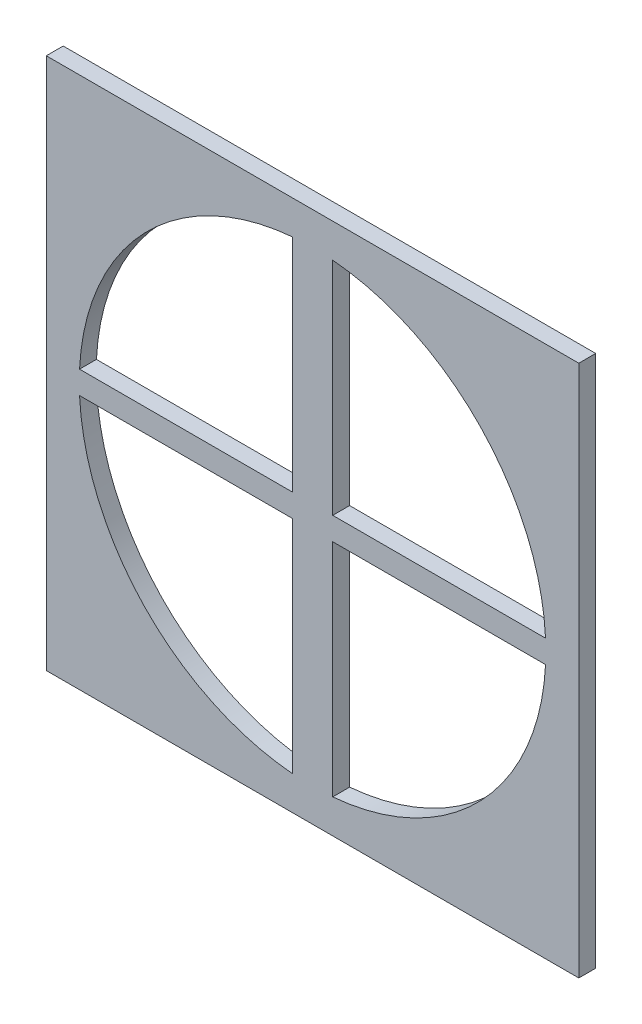
ISO-10303-21;
HEADER;
FILE_DESCRIPTION(('STEP AP214'),'2;1');
FILE_NAME('part.step','',(''),(''),'','','');
FILE_SCHEMA(('AUTOMOTIVE_DESIGN { 1 0 10303 214 1 1 1 1 }'));
ENDSEC;
DATA;
#1=APPLICATION_CONTEXT('core data for automotive mechanical design processes');
#2=APPLICATION_PROTOCOL_DEFINITION('international standard','automotive_design',2000,#1);
#3=PRODUCT_CONTEXT('',#1,'mechanical');
#4=PRODUCT('Part','Part','',(#3));
#5=PRODUCT_RELATED_PRODUCT_CATEGORY('part','',(#4));
#6=PRODUCT_DEFINITION_FORMATION('','',#4);
#7=PRODUCT_DEFINITION_CONTEXT('part definition',#1,'design');
#8=PRODUCT_DEFINITION('design','',#6,#7);
#9=PRODUCT_DEFINITION_SHAPE('','',#8);
#10=(LENGTH_UNIT() NAMED_UNIT(*) SI_UNIT(.MILLI.,.METRE.));
#11=(NAMED_UNIT(*) PLANE_ANGLE_UNIT() SI_UNIT($,.RADIAN.));
#12=(NAMED_UNIT(*) SI_UNIT($,.STERADIAN.) SOLID_ANGLE_UNIT());
#13=UNCERTAINTY_MEASURE_WITH_UNIT(LENGTH_MEASURE(1.E-05),#10,'distance_accuracy_value','');
#14=(GEOMETRIC_REPRESENTATION_CONTEXT(3) GLOBAL_UNCERTAINTY_ASSIGNED_CONTEXT((#13)) GLOBAL_UNIT_ASSIGNED_CONTEXT((#10,
#11,#12)) REPRESENTATION_CONTEXT('',''));
#15=CARTESIAN_POINT('',(0.,0.,0.));
#16=DIRECTION('',(0.,0.,1.));
#17=DIRECTION('',(1.,0.,0.));
#18=AXIS2_PLACEMENT_3D('',#15,#16,#17);
#19=CARTESIAN_POINT('',(0.,0.,0.));
#20=DIRECTION('',(0.,0.,1.));
#21=DIRECTION('',(1.,0.,0.));
#22=AXIS2_PLACEMENT_3D('',#19,#20,#21);
#23=CYLINDRICAL_SURFACE('',#22,35.052);
#24=CARTESIAN_POINT('',(0.,0.,2.54));
#25=DIRECTION('',(0.,0.,1.));
#26=DIRECTION('',(1.,0.,0.));
#27=AXIS2_PLACEMENT_3D('',#24,#25,#26);
#28=CIRCLE('',#27,35.052);
#29=CARTESIAN_POINT('',(-3.03268673599824,-34.9205600636831,2.54));
#30=VERTEX_POINT('',#29);
#31=CARTESIAN_POINT('',(-35.0099405381265,-1.7166151335839,2.54));
#32=VERTEX_POINT('',#31);
#33=EDGE_CURVE('E58',#30,#32,#28,.F.);
#34=ORIENTED_EDGE('',*,*,#33,.F.);
#35=DIRECTION('',(0.,0.,1.));
#36=VECTOR('',#35,1.);
#37=CARTESIAN_POINT('',(-3.03268673599824,-34.9205600636831,0.));
#38=LINE('',#37,#36);
#39=CARTESIAN_POINT('',(-3.03268673599824,-34.9205600636831,0.));
#40=VERTEX_POINT('',#39);
#41=EDGE_CURVE('E244',#40,#30,#38,.T.);
#42=ORIENTED_EDGE('',*,*,#41,.F.);
#43=CARTESIAN_POINT('',(0.,0.,0.));
#44=DIRECTION('',(0.,0.,1.));
#45=DIRECTION('',(1.,0.,0.));
#46=AXIS2_PLACEMENT_3D('',#43,#44,#45);
#47=CIRCLE('',#46,35.052);
#48=CARTESIAN_POINT('',(-35.0099405381265,-1.7166151335839,0.));
#49=VERTEX_POINT('',#48);
#50=EDGE_CURVE('E307',#49,#40,#47,.T.);
#51=ORIENTED_EDGE('',*,*,#50,.F.);
#52=DIRECTION('',(0.,0.,1.));
#53=VECTOR('',#52,1.);
#54=CARTESIAN_POINT('',(-35.0099405381265,-1.7166151335839,0.));
#55=LINE('',#54,#53);
#56=EDGE_CURVE('E250',#49,#32,#55,.T.);
#57=ORIENTED_EDGE('',*,*,#56,.T.);
#58=EDGE_LOOP('',(#34,#42,#51,#57));
#59=FACE_BOUND('',#58,.T.);
#60=ADVANCED_FACE('F35',(#59),#23,.F.);
#61=CARTESIAN_POINT('',(0.,0.,2.54));
#62=DIRECTION('',(0.,0.,1.));
#63=DIRECTION('',(1.,0.,0.));
#64=AXIS2_PLACEMENT_3D('',#61,#62,#63);
#65=CIRCLE('',#64,35.052);
#66=CARTESIAN_POINT('',(-35.0099405381265,1.71661513358393,2.54));
#67=VERTEX_POINT('',#66);
#68=CARTESIAN_POINT('',(-3.03268673599824,34.9205600636831,2.54));
#69=VERTEX_POINT('',#68);
#70=EDGE_CURVE('E291',#67,#69,#65,.F.);
#71=ORIENTED_EDGE('',*,*,#70,.F.);
#72=DIRECTION('',(0.,0.,1.));
#73=VECTOR('',#72,1.);
#74=CARTESIAN_POINT('',(-35.0099405381265,1.71661513358393,0.));
#75=LINE('',#74,#73);
#76=CARTESIAN_POINT('',(-35.0099405381265,1.71661513358393,0.));
#77=VERTEX_POINT('',#76);
#78=EDGE_CURVE('E253',#77,#67,#75,.T.);
#79=ORIENTED_EDGE('',*,*,#78,.F.);
#80=CARTESIAN_POINT('',(-3.03268673599824,34.9205600636831,0.));
#81=VERTEX_POINT('',#80);
#82=EDGE_CURVE('E180',#81,#77,#47,.T.);
#83=ORIENTED_EDGE('',*,*,#82,.F.);
#84=DIRECTION('',(0.,0.,1.));
#85=VECTOR('',#84,1.);
#86=CARTESIAN_POINT('',(-3.03268673599824,34.9205600636831,0.));
#87=LINE('',#86,#85);
#88=EDGE_CURVE('E259',#81,#69,#87,.T.);
#89=ORIENTED_EDGE('',*,*,#88,.T.);
#90=EDGE_LOOP('',(#71,#79,#83,#89));
#91=FACE_BOUND('',#90,.T.);
#92=ADVANCED_FACE('F326',(#91),#23,.F.);
#93=CARTESIAN_POINT('',(0.,0.,2.54));
#94=DIRECTION('',(0.,0.,1.));
#95=DIRECTION('',(1.,0.,0.));
#96=AXIS2_PLACEMENT_3D('',#93,#94,#95);
#97=CIRCLE('',#96,35.052);
#98=CARTESIAN_POINT('',(3.03268673599824,34.9205600636831,2.54));
#99=VERTEX_POINT('',#98);
#100=CARTESIAN_POINT('',(35.0099405381265,1.71661513358393,2.54));
#101=VERTEX_POINT('',#100);
#102=EDGE_CURVE('E272',#99,#101,#97,.F.);
#103=ORIENTED_EDGE('',*,*,#102,.F.);
#104=DIRECTION('',(0.,0.,1.));
#105=VECTOR('',#104,1.);
#106=CARTESIAN_POINT('',(3.03268673599824,34.9205600636831,0.));
#107=LINE('',#106,#105);
#108=CARTESIAN_POINT('',(3.03268673599824,34.9205600636831,0.));
#109=VERTEX_POINT('',#108);
#110=EDGE_CURVE('E262',#109,#99,#107,.T.);
#111=ORIENTED_EDGE('',*,*,#110,.F.);
#112=CARTESIAN_POINT('',(35.0099405381265,1.71661513358393,0.));
#113=VERTEX_POINT('',#112);
#114=EDGE_CURVE('E176',#113,#109,#47,.T.);
#115=ORIENTED_EDGE('',*,*,#114,.F.);
#116=DIRECTION('',(0.,0.,1.));
#117=VECTOR('',#116,1.);
#118=CARTESIAN_POINT('',(35.0099405381265,1.71661513358393,0.));
#119=LINE('',#118,#117);
#120=EDGE_CURVE('E170',#113,#101,#119,.T.);
#121=ORIENTED_EDGE('',*,*,#120,.T.);
#122=EDGE_LOOP('',(#103,#111,#115,#121));
#123=FACE_BOUND('',#122,.T.);
#124=ADVANCED_FACE('F271',(#123),#23,.F.);
#125=CARTESIAN_POINT('',(40.005,-40.0005,5.08));
#126=DIRECTION('',(-1.,0.,0.));
#127=DIRECTION('',(0.,0.,1.));
#128=AXIS2_PLACEMENT_3D('',#125,#126,#127);
#129=PLANE('',#128);
#130=DIRECTION('',(0.,1.,0.));
#131=VECTOR('',#130,1.);
#132=CARTESIAN_POINT('',(40.005,-40.0005,2.54));
#133=LINE('',#132,#131);
#134=CARTESIAN_POINT('',(40.005,-40.0005,2.54));
#135=VERTEX_POINT('',#134);
#136=CARTESIAN_POINT('',(40.005,40.0005,2.54));
#137=VERTEX_POINT('',#136);
#138=EDGE_CURVE('E213',#135,#137,#133,.T.);
#139=ORIENTED_EDGE('',*,*,#138,.F.);
#140=DIRECTION('',(0.,0.,-1.));
#141=VECTOR('',#140,1.);
#142=CARTESIAN_POINT('',(40.005,-40.0005,5.08));
#143=LINE('',#142,#141);
#144=CARTESIAN_POINT('',(40.005,-40.0005,0.));
#145=VERTEX_POINT('',#144);
#146=EDGE_CURVE('E193',#135,#145,#143,.T.);
#147=ORIENTED_EDGE('',*,*,#146,.T.);
#148=DIRECTION('',(0.,1.,0.));
#149=VECTOR('',#148,1.);
#150=CARTESIAN_POINT('',(40.005,-40.0005,0.));
#151=LINE('',#150,#149);
#152=CARTESIAN_POINT('',(40.005,40.0005,0.));
#153=VERTEX_POINT('',#152);
#154=EDGE_CURVE('E179',#145,#153,#151,.T.);
#155=ORIENTED_EDGE('',*,*,#154,.T.);
#156=DIRECTION('',(0.,0.,-1.));
#157=VECTOR('',#156,1.);
#158=CARTESIAN_POINT('',(40.005,40.0005,5.08));
#159=LINE('',#158,#157);
#160=EDGE_CURVE('E43',#137,#153,#159,.T.);
#161=ORIENTED_EDGE('',*,*,#160,.F.);
#162=EDGE_LOOP('',(#139,#147,#155,#161));
#163=FACE_BOUND('',#162,.T.);
#164=ADVANCED_FACE('F37',(#163),#129,.F.);
#165=CARTESIAN_POINT('',(-40.005,40.0005,5.08));
#166=DIRECTION('',(0.,-1.,0.));
#167=DIRECTION('',(0.,0.,-1.));
#168=AXIS2_PLACEMENT_3D('',#165,#166,#167);
#169=PLANE('',#168);
#170=DIRECTION('',(-1.,0.,0.));
#171=VECTOR('',#170,1.);
#172=CARTESIAN_POINT('',(-40.005,40.0005,2.54));
#173=LINE('',#172,#171);
#174=CARTESIAN_POINT('',(-40.005,40.0005,2.54));
#175=VERTEX_POINT('',#174);
#176=EDGE_CURVE('E205',#137,#175,#173,.T.);
#177=ORIENTED_EDGE('',*,*,#176,.F.);
#178=ORIENTED_EDGE('',*,*,#160,.T.);
#179=DIRECTION('',(-1.,0.,0.));
#180=VECTOR('',#179,1.);
#181=CARTESIAN_POINT('',(-40.005,40.0005,0.));
#182=LINE('',#181,#180);
#183=CARTESIAN_POINT('',(-40.005,40.0005,0.));
#184=VERTEX_POINT('',#183);
#185=EDGE_CURVE('E184',#153,#184,#182,.T.);
#186=ORIENTED_EDGE('',*,*,#185,.T.);
#187=DIRECTION('',(0.,0.,-1.));
#188=VECTOR('',#187,1.);
#189=CARTESIAN_POINT('',(-40.005,40.0005,5.08));
#190=LINE('',#189,#188);
#191=EDGE_CURVE('E197',#175,#184,#190,.T.);
#192=ORIENTED_EDGE('',*,*,#191,.F.);
#193=EDGE_LOOP('',(#177,#178,#186,#192));
#194=FACE_BOUND('',#193,.T.);
#195=ADVANCED_FACE('F202',(#194),#169,.F.);
#196=CARTESIAN_POINT('',(-40.005,-40.0005,5.08));
#197=DIRECTION('',(1.,0.,0.));
#198=DIRECTION('',(0.,0.,-1.));
#199=AXIS2_PLACEMENT_3D('',#196,#197,#198);
#200=PLANE('',#199);
#201=DIRECTION('',(0.,-1.,0.));
#202=VECTOR('',#201,1.);
#203=CARTESIAN_POINT('',(-40.005,-40.0005,2.54));
#204=LINE('',#203,#202);
#205=CARTESIAN_POINT('',(-40.005,-40.0005,2.54));
#206=VERTEX_POINT('',#205);
#207=EDGE_CURVE('E50',#175,#206,#204,.T.);
#208=ORIENTED_EDGE('',*,*,#207,.F.);
#209=ORIENTED_EDGE('',*,*,#191,.T.);
#210=DIRECTION('',(0.,-1.,0.));
#211=VECTOR('',#210,1.);
#212=CARTESIAN_POINT('',(-40.005,-40.0005,0.));
#213=LINE('',#212,#211);
#214=CARTESIAN_POINT('',(-40.005,-40.0005,0.));
#215=VERTEX_POINT('',#214);
#216=EDGE_CURVE('E187',#184,#215,#213,.T.);
#217=ORIENTED_EDGE('',*,*,#216,.T.);
#218=DIRECTION('',(0.,0.,-1.));
#219=VECTOR('',#218,1.);
#220=CARTESIAN_POINT('',(-40.005,-40.0005,5.08));
#221=LINE('',#220,#219);
#222=EDGE_CURVE('E195',#206,#215,#221,.T.);
#223=ORIENTED_EDGE('',*,*,#222,.F.);
#224=EDGE_LOOP('',(#208,#209,#217,#223));
#225=FACE_BOUND('',#224,.T.);
#226=ADVANCED_FACE('F219',(#225),#200,.F.);
#227=CARTESIAN_POINT('',(-40.005,-40.0005,5.08));
#228=DIRECTION('',(0.,1.,0.));
#229=DIRECTION('',(0.,0.,1.));
#230=AXIS2_PLACEMENT_3D('',#227,#228,#229);
#231=PLANE('',#230);
#232=DIRECTION('',(1.,0.,0.));
#233=VECTOR('',#232,1.);
#234=CARTESIAN_POINT('',(-40.005,-40.0005,2.54));
#235=LINE('',#234,#233);
#236=EDGE_CURVE('E217',#206,#135,#235,.T.);
#237=ORIENTED_EDGE('',*,*,#236,.F.);
#238=ORIENTED_EDGE('',*,*,#222,.T.);
#239=DIRECTION('',(1.,0.,0.));
#240=VECTOR('',#239,1.);
#241=CARTESIAN_POINT('',(-40.005,-40.0005,0.));
#242=LINE('',#241,#240);
#243=EDGE_CURVE('E190',#215,#145,#242,.T.);
#244=ORIENTED_EDGE('',*,*,#243,.T.);
#245=ORIENTED_EDGE('',*,*,#146,.F.);
#246=EDGE_LOOP('',(#237,#238,#244,#245));
#247=FACE_BOUND('',#246,.T.);
#248=ADVANCED_FACE('F215',(#247),#231,.F.);
#249=CARTESIAN_POINT('',(0.,0.,2.54));
#250=DIRECTION('',(0.,0.,1.));
#251=DIRECTION('',(1.,0.,0.));
#252=AXIS2_PLACEMENT_3D('',#249,#250,#251);
#253=CIRCLE('',#252,35.052);
#254=CARTESIAN_POINT('',(35.0099405381265,-1.7166151335839,2.54));
#255=VERTEX_POINT('',#254);
#256=CARTESIAN_POINT('',(3.03268673599824,-34.9205600636831,2.54));
#257=VERTEX_POINT('',#256);
#258=EDGE_CURVE('E151',#255,#257,#253,.F.);
#259=ORIENTED_EDGE('',*,*,#258,.F.);
#260=DIRECTION('',(0.,0.,1.));
#261=VECTOR('',#260,1.);
#262=CARTESIAN_POINT('',(35.0099405381265,-1.7166151335839,0.));
#263=LINE('',#262,#261);
#264=CARTESIAN_POINT('',(35.0099405381265,-1.7166151335839,0.));
#265=VERTEX_POINT('',#264);
#266=EDGE_CURVE('E162',#265,#255,#263,.T.);
#267=ORIENTED_EDGE('',*,*,#266,.F.);
#268=CARTESIAN_POINT('',(3.03268673599824,-34.9205600636831,0.));
#269=VERTEX_POINT('',#268);
#270=EDGE_CURVE('E181',#269,#265,#47,.T.);
#271=ORIENTED_EDGE('',*,*,#270,.F.);
#272=DIRECTION('',(0.,0.,1.));
#273=VECTOR('',#272,1.);
#274=CARTESIAN_POINT('',(3.03268673599824,-34.9205600636831,0.));
#275=LINE('',#274,#273);
#276=EDGE_CURVE('E168',#269,#257,#275,.T.);
#277=ORIENTED_EDGE('',*,*,#276,.T.);
#278=EDGE_LOOP('',(#259,#267,#271,#277));
#279=FACE_BOUND('',#278,.T.);
#280=ADVANCED_FACE('F312',(#279),#23,.F.);
#281=CARTESIAN_POINT('',(-3.03268673599824,0.,0.));
#282=DIRECTION('',(1.,0.,0.));
#283=DIRECTION('',(0.,0.,-1.));
#284=AXIS2_PLACEMENT_3D('',#281,#282,#283);
#285=PLANE('',#284);
#286=DIRECTION('',(0.,-1.,0.));
#287=VECTOR('',#286,1.);
#288=CARTESIAN_POINT('',(-3.03268673599824,0.,2.54));
#289=LINE('',#288,#287);
#290=CARTESIAN_POINT('',(-3.03268673599824,-1.7166151335839,2.54));
#291=VERTEX_POINT('',#290);
#292=EDGE_CURVE('E295',#291,#30,#289,.T.);
#293=ORIENTED_EDGE('',*,*,#292,.F.);
#294=DIRECTION('',(0.,0.,1.));
#295=VECTOR('',#294,1.);
#296=CARTESIAN_POINT('',(-3.03268673599824,-1.7166151335839,0.));
#297=LINE('',#296,#295);
#298=CARTESIAN_POINT('',(-3.03268673599824,-1.7166151335839,0.));
#299=VERTEX_POINT('',#298);
#300=EDGE_CURVE('E247',#299,#291,#297,.T.);
#301=ORIENTED_EDGE('',*,*,#300,.F.);
#302=DIRECTION('',(0.,1.,0.));
#303=VECTOR('',#302,1.);
#304=CARTESIAN_POINT('',(-3.03268673599824,0.,0.));
#305=LINE('',#304,#303);
#306=EDGE_CURVE('E172',#40,#299,#305,.T.);
#307=ORIENTED_EDGE('',*,*,#306,.F.);
#308=ORIENTED_EDGE('',*,*,#41,.T.);
#309=EDGE_LOOP('',(#293,#301,#307,#308));
#310=FACE_BOUND('',#309,.T.);
#311=ADVANCED_FACE('F303',(#310),#285,.F.);
#312=CARTESIAN_POINT('',(0.,-1.7166151335839,0.));
#313=DIRECTION('',(0.,-1.,0.));
#314=DIRECTION('',(0.,0.,-1.));
#315=AXIS2_PLACEMENT_3D('',#312,#313,#314);
#316=PLANE('',#315);
#317=ORIENTED_EDGE('',*,*,#300,.T.);
#318=DIRECTION('',(-1.,0.,0.));
#319=VECTOR('',#318,1.);
#320=CARTESIAN_POINT('',(0.,-1.7166151335839,2.54));
#321=LINE('',#320,#319);
#322=EDGE_CURVE('E293',#291,#32,#321,.T.);
#323=ORIENTED_EDGE('',*,*,#322,.T.);
#324=ORIENTED_EDGE('',*,*,#56,.F.);
#325=DIRECTION('',(1.,0.,0.));
#326=VECTOR('',#325,1.);
#327=CARTESIAN_POINT('',(0.,-1.7166151335839,0.));
#328=LINE('',#327,#326);
#329=EDGE_CURVE('E240',#49,#299,#328,.T.);
#330=ORIENTED_EDGE('',*,*,#329,.T.);
#331=EDGE_LOOP('',(#317,#323,#324,#330));
#332=FACE_BOUND('',#331,.T.);
#333=ADVANCED_FACE('F319',(#332),#316,.T.);
#334=CARTESIAN_POINT('',(0.,1.71661513358393,0.));
#335=DIRECTION('',(0.,-1.,0.));
#336=DIRECTION('',(0.,0.,-1.));
#337=AXIS2_PLACEMENT_3D('',#334,#335,#336);
#338=PLANE('',#337);
#339=DIRECTION('',(-1.,0.,0.));
#340=VECTOR('',#339,1.);
#341=CARTESIAN_POINT('',(0.,1.71661513358393,2.54));
#342=LINE('',#341,#340);
#343=CARTESIAN_POINT('',(-3.03268673599824,1.71661513358393,2.54));
#344=VERTEX_POINT('',#343);
#345=EDGE_CURVE('E289',#344,#67,#342,.T.);
#346=ORIENTED_EDGE('',*,*,#345,.F.);
#347=DIRECTION('',(0.,0.,1.));
#348=VECTOR('',#347,1.);
#349=CARTESIAN_POINT('',(-3.03268673599824,1.71661513358393,0.));
#350=LINE('',#349,#348);
#351=CARTESIAN_POINT('',(-3.03268673599824,1.71661513358393,0.));
#352=VERTEX_POINT('',#351);
#353=EDGE_CURVE('E256',#352,#344,#350,.T.);
#354=ORIENTED_EDGE('',*,*,#353,.F.);
#355=DIRECTION('',(1.,0.,0.));
#356=VECTOR('',#355,1.);
#357=CARTESIAN_POINT('',(0.,1.71661513358393,0.));
#358=LINE('',#357,#356);
#359=EDGE_CURVE('E238',#77,#352,#358,.T.);
#360=ORIENTED_EDGE('',*,*,#359,.F.);
#361=ORIENTED_EDGE('',*,*,#78,.T.);
#362=EDGE_LOOP('',(#346,#354,#360,#361));
#363=FACE_BOUND('',#362,.T.);
#364=ADVANCED_FACE('F340',(#363),#338,.F.);
#365=CARTESIAN_POINT('',(-3.03268673599824,0.,0.));
#366=DIRECTION('',(1.,0.,0.));
#367=DIRECTION('',(0.,0.,-1.));
#368=AXIS2_PLACEMENT_3D('',#365,#366,#367);
#369=PLANE('',#368);
#370=DIRECTION('',(0.,-1.,0.));
#371=VECTOR('',#370,1.);
#372=CARTESIAN_POINT('',(-3.03268673599824,0.,2.54));
#373=LINE('',#372,#371);
#374=EDGE_CURVE('E287',#69,#344,#373,.T.);
#375=ORIENTED_EDGE('',*,*,#374,.F.);
#376=ORIENTED_EDGE('',*,*,#88,.F.);
#377=DIRECTION('',(0.,1.,0.));
#378=VECTOR('',#377,1.);
#379=CARTESIAN_POINT('',(-3.03268673599824,0.,0.));
#380=LINE('',#379,#378);
#381=EDGE_CURVE('E235',#352,#81,#380,.T.);
#382=ORIENTED_EDGE('',*,*,#381,.F.);
#383=ORIENTED_EDGE('',*,*,#353,.T.);
#384=EDGE_LOOP('',(#375,#376,#382,#383));
#385=FACE_BOUND('',#384,.T.);
#386=ADVANCED_FACE('F345',(#385),#369,.F.);
#387=CARTESIAN_POINT('',(3.03268673599824,0.,0.));
#388=DIRECTION('',(1.,0.,0.));
#389=DIRECTION('',(0.,0.,-1.));
#390=AXIS2_PLACEMENT_3D('',#387,#388,#389);
#391=PLANE('',#390);
#392=ORIENTED_EDGE('',*,*,#110,.T.);
#393=DIRECTION('',(0.,-1.,0.));
#394=VECTOR('',#393,1.);
#395=CARTESIAN_POINT('',(3.03268673599824,0.,2.54));
#396=LINE('',#395,#394);
#397=CARTESIAN_POINT('',(3.03268673599824,1.71661513358393,2.54));
#398=VERTEX_POINT('',#397);
#399=EDGE_CURVE('E281',#99,#398,#396,.T.);
#400=ORIENTED_EDGE('',*,*,#399,.T.);
#401=DIRECTION('',(0.,0.,1.));
#402=VECTOR('',#401,1.);
#403=CARTESIAN_POINT('',(3.03268673599824,1.71661513358393,0.));
#404=LINE('',#403,#402);
#405=CARTESIAN_POINT('',(3.03268673599824,1.71661513358393,0.));
#406=VERTEX_POINT('',#405);
#407=EDGE_CURVE('E265',#406,#398,#404,.T.);
#408=ORIENTED_EDGE('',*,*,#407,.F.);
#409=DIRECTION('',(0.,1.,0.));
#410=VECTOR('',#409,1.);
#411=CARTESIAN_POINT('',(3.03268673599824,0.,0.));
#412=LINE('',#411,#410);
#413=EDGE_CURVE('E232',#406,#109,#412,.T.);
#414=ORIENTED_EDGE('',*,*,#413,.T.);
#415=EDGE_LOOP('',(#392,#400,#408,#414));
#416=FACE_BOUND('',#415,.T.);
#417=ADVANCED_FACE('F359',(#416),#391,.T.);
#418=CARTESIAN_POINT('',(0.,1.71661513358393,0.));
#419=DIRECTION('',(0.,-1.,0.));
#420=DIRECTION('',(0.,0.,-1.));
#421=AXIS2_PLACEMENT_3D('',#418,#419,#420);
#422=PLANE('',#421);
#423=DIRECTION('',(-1.,0.,0.));
#424=VECTOR('',#423,1.);
#425=CARTESIAN_POINT('',(0.,1.71661513358393,2.54));
#426=LINE('',#425,#424);
#427=EDGE_CURVE('E278',#101,#398,#426,.T.);
#428=ORIENTED_EDGE('',*,*,#427,.F.);
#429=ORIENTED_EDGE('',*,*,#120,.F.);
#430=DIRECTION('',(1.,0.,0.));
#431=VECTOR('',#430,1.);
#432=CARTESIAN_POINT('',(0.,1.71661513358393,0.));
#433=LINE('',#432,#431);
#434=EDGE_CURVE('E229',#406,#113,#433,.T.);
#435=ORIENTED_EDGE('',*,*,#434,.F.);
#436=ORIENTED_EDGE('',*,*,#407,.T.);
#437=EDGE_LOOP('',(#428,#429,#435,#436));
#438=FACE_BOUND('',#437,.T.);
#439=ADVANCED_FACE('F276',(#438),#422,.F.);
#440=CARTESIAN_POINT('',(0.,-1.7166151335839,0.));
#441=DIRECTION('',(0.,-1.,0.));
#442=DIRECTION('',(0.,0.,-1.));
#443=AXIS2_PLACEMENT_3D('',#440,#441,#442);
#444=PLANE('',#443);
#445=ORIENTED_EDGE('',*,*,#266,.T.);
#446=DIRECTION('',(-1.,0.,0.));
#447=VECTOR('',#446,1.);
#448=CARTESIAN_POINT('',(0.,-1.7166151335839,2.54));
#449=LINE('',#448,#447);
#450=CARTESIAN_POINT('',(3.03268673599824,-1.7166151335839,2.54));
#451=VERTEX_POINT('',#450);
#452=EDGE_CURVE('E149',#255,#451,#449,.T.);
#453=ORIENTED_EDGE('',*,*,#452,.T.);
#454=DIRECTION('',(0.,0.,1.));
#455=VECTOR('',#454,1.);
#456=CARTESIAN_POINT('',(3.03268673599824,-1.7166151335839,0.));
#457=LINE('',#456,#455);
#458=CARTESIAN_POINT('',(3.03268673599824,-1.7166151335839,0.));
#459=VERTEX_POINT('',#458);
#460=EDGE_CURVE('E160',#459,#451,#457,.T.);
#461=ORIENTED_EDGE('',*,*,#460,.F.);
#462=DIRECTION('',(1.,0.,0.));
#463=VECTOR('',#462,1.);
#464=CARTESIAN_POINT('',(0.,-1.7166151335839,0.));
#465=LINE('',#464,#463);
#466=EDGE_CURVE('E227',#459,#265,#465,.T.);
#467=ORIENTED_EDGE('',*,*,#466,.T.);
#468=EDGE_LOOP('',(#445,#453,#461,#467));
#469=FACE_BOUND('',#468,.T.);
#470=ADVANCED_FACE('F158',(#469),#444,.T.);
#471=CARTESIAN_POINT('',(3.03268673599824,0.,0.));
#472=DIRECTION('',(1.,0.,0.));
#473=DIRECTION('',(0.,0.,-1.));
#474=AXIS2_PLACEMENT_3D('',#471,#472,#473);
#475=PLANE('',#474);
#476=ORIENTED_EDGE('',*,*,#460,.T.);
#477=DIRECTION('',(0.,-1.,0.));
#478=VECTOR('',#477,1.);
#479=CARTESIAN_POINT('',(3.03268673599824,0.,2.54));
#480=LINE('',#479,#478);
#481=EDGE_CURVE('E11',#451,#257,#480,.T.);
#482=ORIENTED_EDGE('',*,*,#481,.T.);
#483=ORIENTED_EDGE('',*,*,#276,.F.);
#484=DIRECTION('',(0.,1.,0.));
#485=VECTOR('',#484,1.);
#486=CARTESIAN_POINT('',(3.03268673599824,0.,0.));
#487=LINE('',#486,#485);
#488=EDGE_CURVE('E167',#269,#459,#487,.T.);
#489=ORIENTED_EDGE('',*,*,#488,.T.);
#490=EDGE_LOOP('',(#476,#482,#483,#489));
#491=FACE_BOUND('',#490,.T.);
#492=ADVANCED_FACE('F165',(#491),#475,.T.);
#493=CARTESIAN_POINT('',(0.,0.,0.));
#494=DIRECTION('',(0.,0.,-1.));
#495=DIRECTION('',(-1.,0.,0.));
#496=AXIS2_PLACEMENT_3D('',#493,#494,#495);
#497=PLANE('',#496);
#498=ORIENTED_EDGE('',*,*,#50,.T.);
#499=ORIENTED_EDGE('',*,*,#306,.T.);
#500=ORIENTED_EDGE('',*,*,#329,.F.);
#501=EDGE_LOOP('',(#498,#499,#500));
#502=FACE_BOUND('',#501,.T.);
#503=ORIENTED_EDGE('',*,*,#82,.T.);
#504=ORIENTED_EDGE('',*,*,#359,.T.);
#505=ORIENTED_EDGE('',*,*,#381,.T.);
#506=EDGE_LOOP('',(#503,#504,#505));
#507=FACE_BOUND('',#506,.T.);
#508=ORIENTED_EDGE('',*,*,#114,.T.);
#509=ORIENTED_EDGE('',*,*,#413,.F.);
#510=ORIENTED_EDGE('',*,*,#434,.T.);
#511=EDGE_LOOP('',(#508,#509,#510));
#512=FACE_BOUND('',#511,.T.);
#513=ORIENTED_EDGE('',*,*,#488,.F.);
#514=ORIENTED_EDGE('',*,*,#270,.T.);
#515=ORIENTED_EDGE('',*,*,#466,.F.);
#516=EDGE_LOOP('',(#513,#514,#515));
#517=FACE_BOUND('',#516,.T.);
#518=ORIENTED_EDGE('',*,*,#154,.F.);
#519=ORIENTED_EDGE('',*,*,#243,.F.);
#520=ORIENTED_EDGE('',*,*,#216,.F.);
#521=ORIENTED_EDGE('',*,*,#185,.F.);
#522=EDGE_LOOP('',(#518,#519,#520,#521));
#523=FACE_BOUND('',#522,.T.);
#524=ADVANCED_FACE('F210',(#502,#507,#512,#517,#523),#497,.T.);
#525=CARTESIAN_POINT('',(0.,0.,2.54));
#526=DIRECTION('',(0.,0.,1.));
#527=DIRECTION('',(1.,0.,0.));
#528=AXIS2_PLACEMENT_3D('',#525,#526,#527);
#529=PLANE('',#528);
#530=ORIENTED_EDGE('',*,*,#33,.T.);
#531=ORIENTED_EDGE('',*,*,#322,.F.);
#532=ORIENTED_EDGE('',*,*,#292,.T.);
#533=EDGE_LOOP('',(#530,#531,#532));
#534=FACE_BOUND('',#533,.T.);
#535=ORIENTED_EDGE('',*,*,#102,.T.);
#536=ORIENTED_EDGE('',*,*,#427,.T.);
#537=ORIENTED_EDGE('',*,*,#399,.F.);
#538=EDGE_LOOP('',(#535,#536,#537));
#539=FACE_BOUND('',#538,.T.);
#540=ORIENTED_EDGE('',*,*,#258,.T.);
#541=ORIENTED_EDGE('',*,*,#481,.F.);
#542=ORIENTED_EDGE('',*,*,#452,.F.);
#543=EDGE_LOOP('',(#540,#541,#542));
#544=FACE_BOUND('',#543,.T.);
#545=ORIENTED_EDGE('',*,*,#70,.T.);
#546=ORIENTED_EDGE('',*,*,#374,.T.);
#547=ORIENTED_EDGE('',*,*,#345,.T.);
#548=EDGE_LOOP('',(#545,#546,#547));
#549=FACE_BOUND('',#548,.T.);
#550=ORIENTED_EDGE('',*,*,#138,.T.);
#551=ORIENTED_EDGE('',*,*,#176,.T.);
#552=ORIENTED_EDGE('',*,*,#207,.T.);
#553=ORIENTED_EDGE('',*,*,#236,.T.);
#554=EDGE_LOOP('',(#550,#551,#552,#553));
#555=FACE_BOUND('',#554,.T.);
#556=ADVANCED_FACE('F147',(#534,#539,#544,#549,#555),#529,.T.);
#557=CLOSED_SHELL('',(#60,#92,#124,#164,#195,#226,#248,#280,#311,#333,#364,#386,#417,#439,#470,
#492,#524,#556));
#558=MANIFOLD_SOLID_BREP('B2',#557);
#559=ADVANCED_BREP_SHAPE_REPRESENTATION('',(#18,#558),#14);
#560=SHAPE_DEFINITION_REPRESENTATION(#9,#559);
ENDSEC;
END-ISO-10303-21;
